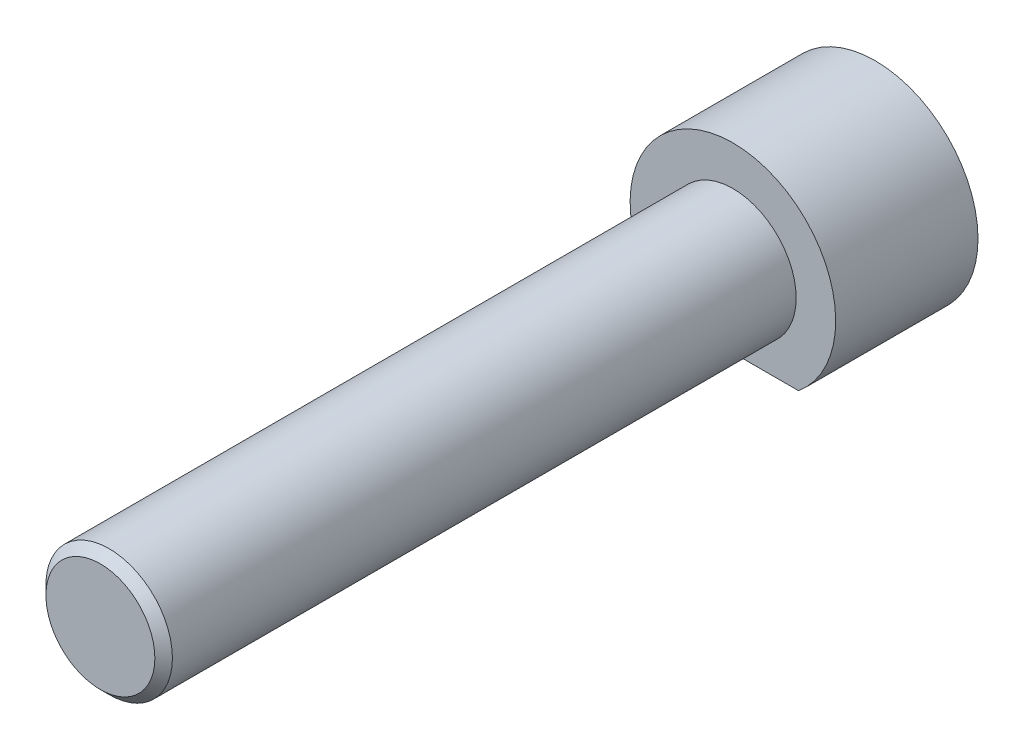
ISO-10303-21;
HEADER;
FILE_DESCRIPTION(('STEP AP214'),'2;1');
FILE_NAME('part.step','',(''),(''),'','','');
FILE_SCHEMA(('AUTOMOTIVE_DESIGN { 1 0 10303 214 1 1 1 1 }'));
ENDSEC;
DATA;
#1=APPLICATION_CONTEXT('core data for automotive mechanical design processes');
#2=APPLICATION_PROTOCOL_DEFINITION('international standard','automotive_design',2000,#1);
#3=PRODUCT_CONTEXT('',#1,'mechanical');
#4=PRODUCT('Part','Part','',(#3));
#5=PRODUCT_RELATED_PRODUCT_CATEGORY('part','',(#4));
#6=PRODUCT_DEFINITION_FORMATION('','',#4);
#7=PRODUCT_DEFINITION_CONTEXT('part definition',#1,'design');
#8=PRODUCT_DEFINITION('design','',#6,#7);
#9=PRODUCT_DEFINITION_SHAPE('','',#8);
#10=(LENGTH_UNIT() NAMED_UNIT(*) SI_UNIT(.MILLI.,.METRE.));
#11=(NAMED_UNIT(*) PLANE_ANGLE_UNIT() SI_UNIT($,.RADIAN.));
#12=(NAMED_UNIT(*) SI_UNIT($,.STERADIAN.) SOLID_ANGLE_UNIT());
#13=UNCERTAINTY_MEASURE_WITH_UNIT(LENGTH_MEASURE(1.E-05),#10,'distance_accuracy_value','');
#14=(GEOMETRIC_REPRESENTATION_CONTEXT(3) GLOBAL_UNCERTAINTY_ASSIGNED_CONTEXT((#13)) GLOBAL_UNIT_ASSIGNED_CONTEXT((#10,
#11,#12)) REPRESENTATION_CONTEXT('',''));
#15=CARTESIAN_POINT('',(0.,0.,0.));
#16=DIRECTION('',(0.,0.,1.));
#17=DIRECTION('',(1.,0.,0.));
#18=AXIS2_PLACEMENT_3D('',#15,#16,#17);
#19=CARTESIAN_POINT('',(0.,0.,8.99999999999999));
#20=DIRECTION('',(0.,0.,1.));
#21=DIRECTION('',(1.,0.,0.));
#22=AXIS2_PLACEMENT_3D('',#19,#20,#21);
#23=PLANE('',#22);
#24=DIRECTION('',(1.,0.,0.));
#25=VECTOR('',#24,1.);
#26=CARTESIAN_POINT('',(0.,-5.,9.00000000000001));
#27=LINE('',#26,#25);
#28=CARTESIAN_POINT('',(-4.15331193145904,-5.,9.00000000000001));
#29=VERTEX_POINT('',#28);
#30=CARTESIAN_POINT('',(4.15331193145904,-5.,9.00000000000001));
#31=VERTEX_POINT('',#30);
#32=EDGE_CURVE('E76',#29,#31,#27,.T.);
#33=ORIENTED_EDGE('',*,*,#32,.T.);
#34=CARTESIAN_POINT('',(0.,0.,8.99999999999999));
#35=DIRECTION('',(0.,0.,1.));
#36=DIRECTION('',(1.,0.,0.));
#37=AXIS2_PLACEMENT_3D('',#34,#35,#36);
#38=CIRCLE('',#37,6.5);
#39=EDGE_CURVE('E58',#31,#29,#38,.T.);
#40=ORIENTED_EDGE('',*,*,#39,.T.);
#41=EDGE_LOOP('',(#33,#40));
#42=FACE_BOUND('',#41,.T.);
#43=CARTESIAN_POINT('',(0.,0.,8.99999999999999));
#44=DIRECTION('',(0.,0.,1.));
#45=DIRECTION('',(1.,0.,0.));
#46=AXIS2_PLACEMENT_3D('',#43,#44,#45);
#47=CIRCLE('',#46,4.);
#48=CARTESIAN_POINT('',(4.,0.,8.99999999999999));
#49=VERTEX_POINT('',#48);
#50=EDGE_CURVE('E83',#49,#49,#47,.T.);
#51=ORIENTED_EDGE('',*,*,#50,.F.);
#52=EDGE_LOOP('',(#51));
#53=FACE_BOUND('',#52,.T.);
#54=ADVANCED_FACE('F42',(#42,#53),#23,.T.);
#55=CARTESIAN_POINT('',(0.,-5.,9.00000000000001));
#56=DIRECTION('',(0.,1.,0.));
#57=DIRECTION('',(0.,0.,1.));
#58=AXIS2_PLACEMENT_3D('',#55,#56,#57);
#59=PLANE('',#58);
#60=DIRECTION('',(1.,0.,0.));
#61=VECTOR('',#60,1.);
#62=CARTESIAN_POINT('',(0.,-5.,0.));
#63=LINE('',#62,#61);
#64=CARTESIAN_POINT('',(-4.15331193145904,-5.,0.));
#65=VERTEX_POINT('',#64);
#66=CARTESIAN_POINT('',(4.15331193145904,-5.,0.));
#67=VERTEX_POINT('',#66);
#68=EDGE_CURVE('E77',#65,#67,#63,.T.);
#69=ORIENTED_EDGE('',*,*,#68,.T.);
#70=DIRECTION('',(0.,0.,-1.));
#71=VECTOR('',#70,1.);
#72=CARTESIAN_POINT('',(4.15331193145904,-5.,9.00000000000001));
#73=LINE('',#72,#71);
#74=EDGE_CURVE('E74',#31,#67,#73,.T.);
#75=ORIENTED_EDGE('',*,*,#74,.F.);
#76=ORIENTED_EDGE('',*,*,#32,.F.);
#77=DIRECTION('',(0.,0.,-1.));
#78=VECTOR('',#77,1.);
#79=CARTESIAN_POINT('',(-4.15331193145904,-5.,9.00000000000001));
#80=LINE('',#79,#78);
#81=EDGE_CURVE('E71',#29,#65,#80,.T.);
#82=ORIENTED_EDGE('',*,*,#81,.T.);
#83=EDGE_LOOP('',(#69,#75,#76,#82));
#84=FACE_BOUND('',#83,.T.);
#85=ADVANCED_FACE('F80',(#84),#59,.F.);
#86=CARTESIAN_POINT('',(0.,0.,8.99999999999999));
#87=DIRECTION('',(0.,0.,-1.));
#88=DIRECTION('',(-1.,0.,0.));
#89=AXIS2_PLACEMENT_3D('',#86,#87,#88);
#90=CYLINDRICAL_SURFACE('',#89,6.5);
#91=CARTESIAN_POINT('',(0.,0.,0.));
#92=DIRECTION('',(0.,0.,1.));
#93=DIRECTION('',(1.,0.,0.));
#94=AXIS2_PLACEMENT_3D('',#91,#92,#93);
#95=CIRCLE('',#94,6.5);
#96=EDGE_CURVE('E66',#67,#65,#95,.T.);
#97=ORIENTED_EDGE('',*,*,#96,.T.);
#98=ORIENTED_EDGE('',*,*,#81,.F.);
#99=ORIENTED_EDGE('',*,*,#39,.F.);
#100=ORIENTED_EDGE('',*,*,#74,.T.);
#101=EDGE_LOOP('',(#97,#98,#99,#100));
#102=FACE_BOUND('',#101,.T.);
#103=ADVANCED_FACE('F70',(#102),#90,.T.);
#104=CARTESIAN_POINT('',(0.,0.,0.));
#105=DIRECTION('',(0.,0.,1.));
#106=DIRECTION('',(1.,0.,0.));
#107=AXIS2_PLACEMENT_3D('',#104,#105,#106);
#108=PLANE('',#107);
#109=ORIENTED_EDGE('',*,*,#68,.F.);
#110=ORIENTED_EDGE('',*,*,#96,.F.);
#111=EDGE_LOOP('',(#109,#110));
#112=FACE_BOUND('',#111,.T.);
#113=ADVANCED_FACE('F82',(#112),#108,.F.);
#114=CARTESIAN_POINT('',(0.,0.,49.0000000000001));
#115=DIRECTION('',(0.,0.,-1.));
#116=DIRECTION('',(-1.,0.,0.));
#117=AXIS2_PLACEMENT_3D('',#114,#115,#116);
#118=CYLINDRICAL_SURFACE('',#117,4.);
#119=CARTESIAN_POINT('',(0.,0.,48.4455000000001));
#120=DIRECTION('',(0.,0.,1.));
#121=DIRECTION('',(1.,0.,0.));
#122=AXIS2_PLACEMENT_3D('',#119,#120,#121);
#123=CIRCLE('',#122,4.);
#124=CARTESIAN_POINT('',(4.,0.,48.4455000000001));
#125=VERTEX_POINT('',#124);
#126=EDGE_CURVE('E11',#125,#125,#123,.F.);
#127=ORIENTED_EDGE('',*,*,#126,.T.);
#128=EDGE_LOOP('',(#127));
#129=FACE_BOUND('',#128,.T.);
#130=ORIENTED_EDGE('',*,*,#50,.T.);
#131=EDGE_LOOP('',(#130));
#132=FACE_BOUND('',#131,.T.);
#133=ADVANCED_FACE('F100',(#129,#132),#118,.T.);
#134=CARTESIAN_POINT('',(0.,0.,49.0000000000001));
#135=DIRECTION('',(0.,0.,1.));
#136=DIRECTION('',(1.,0.,0.));
#137=AXIS2_PLACEMENT_3D('',#134,#135,#136);
#138=PLANE('',#137);
#139=CARTESIAN_POINT('',(0.,0.,49.0000000000001));
#140=DIRECTION('',(0.,0.,1.));
#141=DIRECTION('',(1.,0.,0.));
#142=AXIS2_PLACEMENT_3D('',#139,#140,#141);
#143=CIRCLE('',#142,3.44549999999999);
#144=CARTESIAN_POINT('',(3.44549999999999,0.,49.0000000000001));
#145=VERTEX_POINT('',#144);
#146=EDGE_CURVE('E51',#145,#145,#143,.T.);
#147=ORIENTED_EDGE('',*,*,#146,.T.);
#148=EDGE_LOOP('',(#147));
#149=FACE_BOUND('',#148,.T.);
#150=ADVANCED_FACE('F93',(#149),#138,.T.);
#151=CARTESIAN_POINT('',(0.,0.,49.0000000000001));
#152=DIRECTION('',(0.,0.,-1.));
#153=DIRECTION('',(-1.,0.,0.));
#154=AXIS2_PLACEMENT_3D('',#151,#152,#153);
#155=CONICAL_SURFACE('',#154,3.44549999999999,0.785398163397451);
#156=ORIENTED_EDGE('',*,*,#126,.F.);
#157=EDGE_LOOP('',(#156));
#158=FACE_BOUND('',#157,.T.);
#159=ORIENTED_EDGE('',*,*,#146,.F.);
#160=EDGE_LOOP('',(#159));
#161=FACE_BOUND('',#160,.T.);
#162=ADVANCED_FACE('F44',(#158,#161),#155,.T.);
#163=CLOSED_SHELL('',(#54,#85,#103,#113,#133,#150,#162));
#164=MANIFOLD_SOLID_BREP('B2',#163);
#165=ADVANCED_BREP_SHAPE_REPRESENTATION('',(#18,#164),#14);
#166=SHAPE_DEFINITION_REPRESENTATION(#9,#165);
ENDSEC;
END-ISO-10303-21;
